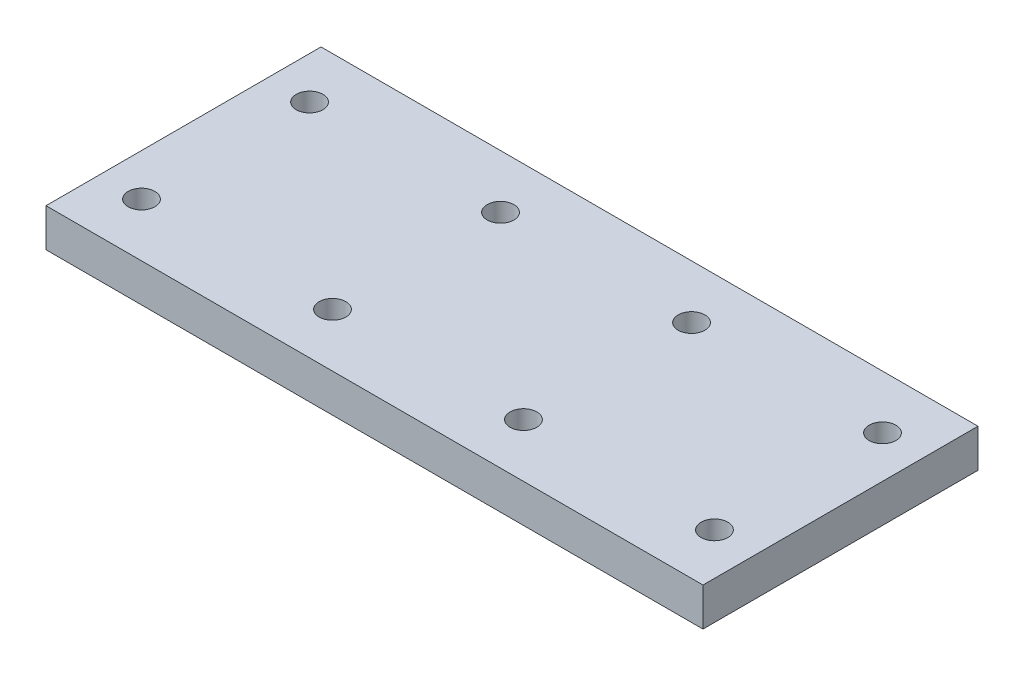
ISO-10303-21;
HEADER;
FILE_DESCRIPTION(('STEP AP214'),'2;1');
FILE_NAME('part.step','',(''),(''),'','','');
FILE_SCHEMA(('AUTOMOTIVE_DESIGN { 1 0 10303 214 1 1 1 1 }'));
ENDSEC;
DATA;
#1=APPLICATION_CONTEXT('core data for automotive mechanical design processes');
#2=APPLICATION_PROTOCOL_DEFINITION('international standard','automotive_design',2000,#1);
#3=PRODUCT_CONTEXT('',#1,'mechanical');
#4=PRODUCT('Part','Part','',(#3));
#5=PRODUCT_RELATED_PRODUCT_CATEGORY('part','',(#4));
#6=PRODUCT_DEFINITION_FORMATION('','',#4);
#7=PRODUCT_DEFINITION_CONTEXT('part definition',#1,'design');
#8=PRODUCT_DEFINITION('design','',#6,#7);
#9=PRODUCT_DEFINITION_SHAPE('','',#8);
#10=(LENGTH_UNIT() NAMED_UNIT(*) SI_UNIT(.MILLI.,.METRE.));
#11=(NAMED_UNIT(*) PLANE_ANGLE_UNIT() SI_UNIT($,.RADIAN.));
#12=(NAMED_UNIT(*) SI_UNIT($,.STERADIAN.) SOLID_ANGLE_UNIT());
#13=UNCERTAINTY_MEASURE_WITH_UNIT(LENGTH_MEASURE(1.E-05),#10,'distance_accuracy_value','');
#14=(GEOMETRIC_REPRESENTATION_CONTEXT(3) GLOBAL_UNCERTAINTY_ASSIGNED_CONTEXT((#13)) GLOBAL_UNIT_ASSIGNED_CONTEXT((#10,
#11,#12)) REPRESENTATION_CONTEXT('',''));
#15=CARTESIAN_POINT('',(0.,0.,0.));
#16=DIRECTION('',(0.,0.,1.));
#17=DIRECTION('',(1.,0.,0.));
#18=AXIS2_PLACEMENT_3D('',#15,#16,#17);
#19=CARTESIAN_POINT('',(43.,5.,-18.));
#20=DIRECTION('',(-1.,0.,0.));
#21=DIRECTION('',(0.,0.,1.));
#22=AXIS2_PLACEMENT_3D('',#19,#20,#21);
#23=PLANE('',#22);
#24=DIRECTION('',(0.,0.,-1.));
#25=VECTOR('',#24,1.);
#26=CARTESIAN_POINT('',(43.,0.,-18.));
#27=LINE('',#26,#25);
#28=CARTESIAN_POINT('',(43.,0.,18.));
#29=VERTEX_POINT('',#28);
#30=CARTESIAN_POINT('',(43.,0.,-18.));
#31=VERTEX_POINT('',#30);
#32=EDGE_CURVE('E98',#29,#31,#27,.T.);
#33=ORIENTED_EDGE('',*,*,#32,.T.);
#34=DIRECTION('',(0.,-1.,0.));
#35=VECTOR('',#34,1.);
#36=CARTESIAN_POINT('',(43.,5.,-18.));
#37=LINE('',#36,#35);
#38=CARTESIAN_POINT('',(43.,5.,-18.));
#39=VERTEX_POINT('',#38);
#40=EDGE_CURVE('E11',#39,#31,#37,.T.);
#41=ORIENTED_EDGE('',*,*,#40,.F.);
#42=DIRECTION('',(0.,0.,-1.));
#43=VECTOR('',#42,1.);
#44=CARTESIAN_POINT('',(43.,5.,-18.));
#45=LINE('',#44,#43);
#46=CARTESIAN_POINT('',(43.,5.,18.));
#47=VERTEX_POINT('',#46);
#48=EDGE_CURVE('E86',#47,#39,#45,.T.);
#49=ORIENTED_EDGE('',*,*,#48,.F.);
#50=DIRECTION('',(0.,-1.,0.));
#51=VECTOR('',#50,1.);
#52=CARTESIAN_POINT('',(43.,5.,18.));
#53=LINE('',#52,#51);
#54=EDGE_CURVE('E94',#47,#29,#53,.T.);
#55=ORIENTED_EDGE('',*,*,#54,.T.);
#56=EDGE_LOOP('',(#33,#41,#49,#55));
#57=FACE_BOUND('',#56,.T.);
#58=ADVANCED_FACE('F35',(#57),#23,.F.);
#59=CARTESIAN_POINT('',(-43.,5.,-18.));
#60=DIRECTION('',(0.,0.,1.));
#61=DIRECTION('',(1.,0.,0.));
#62=AXIS2_PLACEMENT_3D('',#59,#60,#61);
#63=PLANE('',#62);
#64=DIRECTION('',(-1.,0.,0.));
#65=VECTOR('',#64,1.);
#66=CARTESIAN_POINT('',(-43.,0.,-18.));
#67=LINE('',#66,#65);
#68=CARTESIAN_POINT('',(-43.,0.,-18.));
#69=VERTEX_POINT('',#68);
#70=EDGE_CURVE('E90',#31,#69,#67,.T.);
#71=ORIENTED_EDGE('',*,*,#70,.T.);
#72=DIRECTION('',(0.,-1.,0.));
#73=VECTOR('',#72,1.);
#74=CARTESIAN_POINT('',(-43.,5.,-18.));
#75=LINE('',#74,#73);
#76=CARTESIAN_POINT('',(-43.,5.,-18.));
#77=VERTEX_POINT('',#76);
#78=EDGE_CURVE('E43',#77,#69,#75,.T.);
#79=ORIENTED_EDGE('',*,*,#78,.F.);
#80=DIRECTION('',(-1.,0.,0.));
#81=VECTOR('',#80,1.);
#82=CARTESIAN_POINT('',(-43.,5.,-18.));
#83=LINE('',#82,#81);
#84=EDGE_CURVE('E81',#39,#77,#83,.T.);
#85=ORIENTED_EDGE('',*,*,#84,.F.);
#86=ORIENTED_EDGE('',*,*,#40,.T.);
#87=EDGE_LOOP('',(#71,#79,#85,#86));
#88=FACE_BOUND('',#87,.T.);
#89=ADVANCED_FACE('F89',(#88),#63,.F.);
#90=CARTESIAN_POINT('',(-43.,5.,-18.));
#91=DIRECTION('',(1.,0.,0.));
#92=DIRECTION('',(0.,0.,-1.));
#93=AXIS2_PLACEMENT_3D('',#90,#91,#92);
#94=PLANE('',#93);
#95=DIRECTION('',(0.,0.,1.));
#96=VECTOR('',#95,1.);
#97=CARTESIAN_POINT('',(-43.,0.,-18.));
#98=LINE('',#97,#96);
#99=CARTESIAN_POINT('',(-43.,0.,18.));
#100=VERTEX_POINT('',#99);
#101=EDGE_CURVE('E68',#69,#100,#98,.T.);
#102=ORIENTED_EDGE('',*,*,#101,.T.);
#103=DIRECTION('',(0.,-1.,0.));
#104=VECTOR('',#103,1.);
#105=CARTESIAN_POINT('',(-43.,5.,18.));
#106=LINE('',#105,#104);
#107=CARTESIAN_POINT('',(-43.,5.,18.));
#108=VERTEX_POINT('',#107);
#109=EDGE_CURVE('E91',#108,#100,#106,.T.);
#110=ORIENTED_EDGE('',*,*,#109,.F.);
#111=DIRECTION('',(0.,0.,1.));
#112=VECTOR('',#111,1.);
#113=CARTESIAN_POINT('',(-43.,5.,-18.));
#114=LINE('',#113,#112);
#115=EDGE_CURVE('E84',#77,#108,#114,.T.);
#116=ORIENTED_EDGE('',*,*,#115,.F.);
#117=ORIENTED_EDGE('',*,*,#78,.T.);
#118=EDGE_LOOP('',(#102,#110,#116,#117));
#119=FACE_BOUND('',#118,.T.);
#120=ADVANCED_FACE('F92',(#119),#94,.F.);
#121=CARTESIAN_POINT('',(-43.,5.,18.));
#122=DIRECTION('',(0.,0.,-1.));
#123=DIRECTION('',(-1.,0.,0.));
#124=AXIS2_PLACEMENT_3D('',#121,#122,#123);
#125=PLANE('',#124);
#126=DIRECTION('',(1.,0.,0.));
#127=VECTOR('',#126,1.);
#128=CARTESIAN_POINT('',(-43.,0.,18.));
#129=LINE('',#128,#127);
#130=EDGE_CURVE('E74',#100,#29,#129,.T.);
#131=ORIENTED_EDGE('',*,*,#130,.T.);
#132=ORIENTED_EDGE('',*,*,#54,.F.);
#133=DIRECTION('',(1.,0.,0.));
#134=VECTOR('',#133,1.);
#135=CARTESIAN_POINT('',(-43.,5.,18.));
#136=LINE('',#135,#134);
#137=EDGE_CURVE('E51',#108,#47,#136,.T.);
#138=ORIENTED_EDGE('',*,*,#137,.F.);
#139=ORIENTED_EDGE('',*,*,#109,.T.);
#140=EDGE_LOOP('',(#131,#132,#138,#139));
#141=FACE_BOUND('',#140,.T.);
#142=ADVANCED_FACE('F106',(#141),#125,.F.);
#143=CARTESIAN_POINT('',(0.,5.,0.));
#144=DIRECTION('',(0.,1.,0.));
#145=DIRECTION('',(0.,0.,1.));
#146=AXIS2_PLACEMENT_3D('',#143,#144,#145);
#147=PLANE('',#146);
#148=CARTESIAN_POINT('',(-37.5,5.,-11.));
#149=DIRECTION('',(0.,-1.,0.));
#150=DIRECTION('',(0.,0.,-1.));
#151=AXIS2_PLACEMENT_3D('',#148,#149,#150);
#152=CIRCLE('',#151,1.75);
#153=CARTESIAN_POINT('',(-37.5,5.,-12.75));
#154=VERTEX_POINT('',#153);
#155=EDGE_CURVE('E151',#154,#154,#152,.T.);
#156=ORIENTED_EDGE('',*,*,#155,.T.);
#157=EDGE_LOOP('',(#156));
#158=FACE_BOUND('',#157,.T.);
#159=CARTESIAN_POINT('',(-37.5,5.,11.));
#160=DIRECTION('',(0.,1.,0.));
#161=DIRECTION('',(0.,0.,1.));
#162=AXIS2_PLACEMENT_3D('',#159,#160,#161);
#163=CIRCLE('',#162,1.75);
#164=CARTESIAN_POINT('',(-37.5,5.,12.75));
#165=VERTEX_POINT('',#164);
#166=EDGE_CURVE('E145',#165,#165,#163,.T.);
#167=ORIENTED_EDGE('',*,*,#166,.F.);
#168=EDGE_LOOP('',(#167));
#169=FACE_BOUND('',#168,.T.);
#170=CARTESIAN_POINT('',(-12.5,5.,11.));
#171=DIRECTION('',(0.,1.,0.));
#172=DIRECTION('',(0.,0.,1.));
#173=AXIS2_PLACEMENT_3D('',#170,#171,#172);
#174=CIRCLE('',#173,1.75);
#175=CARTESIAN_POINT('',(-12.5,5.,12.75));
#176=VERTEX_POINT('',#175);
#177=EDGE_CURVE('E139',#176,#176,#174,.F.);
#178=ORIENTED_EDGE('',*,*,#177,.T.);
#179=EDGE_LOOP('',(#178));
#180=FACE_BOUND('',#179,.T.);
#181=CARTESIAN_POINT('',(-12.5,5.,-11.));
#182=DIRECTION('',(0.,1.,0.));
#183=DIRECTION('',(0.,0.,1.));
#184=AXIS2_PLACEMENT_3D('',#181,#182,#183);
#185=CIRCLE('',#184,1.75);
#186=CARTESIAN_POINT('',(-12.5,5.,-9.24999999999999));
#187=VERTEX_POINT('',#186);
#188=EDGE_CURVE('E133',#187,#187,#185,.T.);
#189=ORIENTED_EDGE('',*,*,#188,.F.);
#190=EDGE_LOOP('',(#189));
#191=FACE_BOUND('',#190,.T.);
#192=CARTESIAN_POINT('',(12.5,5.,-11.));
#193=DIRECTION('',(0.,1.,0.));
#194=DIRECTION('',(0.,0.,1.));
#195=AXIS2_PLACEMENT_3D('',#192,#193,#194);
#196=CIRCLE('',#195,1.75);
#197=CARTESIAN_POINT('',(12.5,5.,-9.24999999999999));
#198=VERTEX_POINT('',#197);
#199=EDGE_CURVE('E127',#198,#198,#196,.F.);
#200=ORIENTED_EDGE('',*,*,#199,.T.);
#201=EDGE_LOOP('',(#200));
#202=FACE_BOUND('',#201,.T.);
#203=CARTESIAN_POINT('',(37.5,5.,-11.));
#204=DIRECTION('',(0.,1.,0.));
#205=DIRECTION('',(0.,0.,1.));
#206=AXIS2_PLACEMENT_3D('',#203,#204,#205);
#207=CIRCLE('',#206,1.75);
#208=CARTESIAN_POINT('',(37.5,5.,-9.24999999999999));
#209=VERTEX_POINT('',#208);
#210=EDGE_CURVE('E121',#209,#209,#207,.T.);
#211=ORIENTED_EDGE('',*,*,#210,.F.);
#212=EDGE_LOOP('',(#211));
#213=FACE_BOUND('',#212,.T.);
#214=CARTESIAN_POINT('',(12.5,5.,11.));
#215=DIRECTION('',(0.,1.,0.));
#216=DIRECTION('',(0.,0.,1.));
#217=AXIS2_PLACEMENT_3D('',#214,#215,#216);
#218=CIRCLE('',#217,1.75);
#219=CARTESIAN_POINT('',(12.5,5.,12.75));
#220=VERTEX_POINT('',#219);
#221=EDGE_CURVE('E115',#220,#220,#218,.T.);
#222=ORIENTED_EDGE('',*,*,#221,.F.);
#223=EDGE_LOOP('',(#222));
#224=FACE_BOUND('',#223,.T.);
#225=CARTESIAN_POINT('',(37.5,5.,11.));
#226=DIRECTION('',(0.,1.,0.));
#227=DIRECTION('',(0.,0.,1.));
#228=AXIS2_PLACEMENT_3D('',#225,#226,#227);
#229=CIRCLE('',#228,1.75);
#230=CARTESIAN_POINT('',(37.5,5.,12.75));
#231=VERTEX_POINT('',#230);
#232=EDGE_CURVE('E112',#231,#231,#229,.F.);
#233=ORIENTED_EDGE('',*,*,#232,.T.);
#234=EDGE_LOOP('',(#233));
#235=FACE_BOUND('',#234,.T.);
#236=ORIENTED_EDGE('',*,*,#48,.T.);
#237=ORIENTED_EDGE('',*,*,#84,.T.);
#238=ORIENTED_EDGE('',*,*,#115,.T.);
#239=ORIENTED_EDGE('',*,*,#137,.T.);
#240=EDGE_LOOP('',(#236,#237,#238,#239));
#241=FACE_BOUND('',#240,.T.);
#242=ADVANCED_FACE('F82',(#158,#169,#180,#191,#202,#213,#224,#235,#241),#147,.T.);
#243=CARTESIAN_POINT('',(0.,0.,0.));
#244=DIRECTION('',(0.,1.,0.));
#245=DIRECTION('',(0.,0.,1.));
#246=AXIS2_PLACEMENT_3D('',#243,#244,#245);
#247=PLANE('',#246);
#248=CARTESIAN_POINT('',(-37.5,0.,-11.));
#249=DIRECTION('',(0.,-1.,0.));
#250=DIRECTION('',(0.,0.,-1.));
#251=AXIS2_PLACEMENT_3D('',#248,#249,#250);
#252=CIRCLE('',#251,1.75);
#253=CARTESIAN_POINT('',(-37.5,0.,-12.75));
#254=VERTEX_POINT('',#253);
#255=EDGE_CURVE('E154',#254,#254,#252,.T.);
#256=ORIENTED_EDGE('',*,*,#255,.F.);
#257=EDGE_LOOP('',(#256));
#258=FACE_BOUND('',#257,.T.);
#259=CARTESIAN_POINT('',(-37.5,0.,11.));
#260=DIRECTION('',(0.,1.,0.));
#261=DIRECTION('',(0.,0.,1.));
#262=AXIS2_PLACEMENT_3D('',#259,#260,#261);
#263=CIRCLE('',#262,1.75);
#264=CARTESIAN_POINT('',(-37.5,0.,12.75));
#265=VERTEX_POINT('',#264);
#266=EDGE_CURVE('E148',#265,#265,#263,.T.);
#267=ORIENTED_EDGE('',*,*,#266,.T.);
#268=EDGE_LOOP('',(#267));
#269=FACE_BOUND('',#268,.T.);
#270=CARTESIAN_POINT('',(-12.5,0.,11.));
#271=DIRECTION('',(0.,1.,0.));
#272=DIRECTION('',(0.,0.,1.));
#273=AXIS2_PLACEMENT_3D('',#270,#271,#272);
#274=CIRCLE('',#273,1.75);
#275=CARTESIAN_POINT('',(-12.5,0.,12.75));
#276=VERTEX_POINT('',#275);
#277=EDGE_CURVE('E142',#276,#276,#274,.F.);
#278=ORIENTED_EDGE('',*,*,#277,.F.);
#279=EDGE_LOOP('',(#278));
#280=FACE_BOUND('',#279,.T.);
#281=CARTESIAN_POINT('',(-12.5,0.,-11.));
#282=DIRECTION('',(0.,1.,0.));
#283=DIRECTION('',(0.,0.,1.));
#284=AXIS2_PLACEMENT_3D('',#281,#282,#283);
#285=CIRCLE('',#284,1.75);
#286=CARTESIAN_POINT('',(-12.5,0.,-9.24999999999999));
#287=VERTEX_POINT('',#286);
#288=EDGE_CURVE('E136',#287,#287,#285,.T.);
#289=ORIENTED_EDGE('',*,*,#288,.T.);
#290=EDGE_LOOP('',(#289));
#291=FACE_BOUND('',#290,.T.);
#292=CARTESIAN_POINT('',(12.5,0.,-11.));
#293=DIRECTION('',(0.,1.,0.));
#294=DIRECTION('',(0.,0.,1.));
#295=AXIS2_PLACEMENT_3D('',#292,#293,#294);
#296=CIRCLE('',#295,1.75);
#297=CARTESIAN_POINT('',(12.5,0.,-9.24999999999999));
#298=VERTEX_POINT('',#297);
#299=EDGE_CURVE('E130',#298,#298,#296,.F.);
#300=ORIENTED_EDGE('',*,*,#299,.F.);
#301=EDGE_LOOP('',(#300));
#302=FACE_BOUND('',#301,.T.);
#303=CARTESIAN_POINT('',(37.5,0.,-11.));
#304=DIRECTION('',(0.,1.,0.));
#305=DIRECTION('',(0.,0.,1.));
#306=AXIS2_PLACEMENT_3D('',#303,#304,#305);
#307=CIRCLE('',#306,1.75);
#308=CARTESIAN_POINT('',(37.5,0.,-9.24999999999999));
#309=VERTEX_POINT('',#308);
#310=EDGE_CURVE('E124',#309,#309,#307,.T.);
#311=ORIENTED_EDGE('',*,*,#310,.T.);
#312=EDGE_LOOP('',(#311));
#313=FACE_BOUND('',#312,.T.);
#314=CARTESIAN_POINT('',(12.5,0.,11.));
#315=DIRECTION('',(0.,1.,0.));
#316=DIRECTION('',(0.,0.,1.));
#317=AXIS2_PLACEMENT_3D('',#314,#315,#316);
#318=CIRCLE('',#317,1.75);
#319=CARTESIAN_POINT('',(12.5,0.,12.75));
#320=VERTEX_POINT('',#319);
#321=EDGE_CURVE('E118',#320,#320,#318,.T.);
#322=ORIENTED_EDGE('',*,*,#321,.T.);
#323=EDGE_LOOP('',(#322));
#324=FACE_BOUND('',#323,.T.);
#325=CARTESIAN_POINT('',(37.5,0.,11.));
#326=DIRECTION('',(0.,1.,0.));
#327=DIRECTION('',(0.,0.,1.));
#328=AXIS2_PLACEMENT_3D('',#325,#326,#327);
#329=CIRCLE('',#328,1.75);
#330=CARTESIAN_POINT('',(37.5,0.,12.75));
#331=VERTEX_POINT('',#330);
#332=EDGE_CURVE('E101',#331,#331,#329,.F.);
#333=ORIENTED_EDGE('',*,*,#332,.F.);
#334=EDGE_LOOP('',(#333));
#335=FACE_BOUND('',#334,.T.);
#336=ORIENTED_EDGE('',*,*,#32,.F.);
#337=ORIENTED_EDGE('',*,*,#130,.F.);
#338=ORIENTED_EDGE('',*,*,#101,.F.);
#339=ORIENTED_EDGE('',*,*,#70,.F.);
#340=EDGE_LOOP('',(#336,#337,#338,#339));
#341=FACE_BOUND('',#340,.T.);
#342=ADVANCED_FACE('F109',(#258,#269,#280,#291,#302,#313,#324,#335,#341),#247,.F.);
#343=CARTESIAN_POINT('',(37.5,0.,11.));
#344=DIRECTION('',(0.,1.,0.));
#345=DIRECTION('',(0.,0.,1.));
#346=AXIS2_PLACEMENT_3D('',#343,#344,#345);
#347=CYLINDRICAL_SURFACE('',#346,1.75);
#348=ORIENTED_EDGE('',*,*,#332,.T.);
#349=EDGE_LOOP('',(#348));
#350=FACE_BOUND('',#349,.T.);
#351=ORIENTED_EDGE('',*,*,#232,.F.);
#352=EDGE_LOOP('',(#351));
#353=FACE_BOUND('',#352,.T.);
#354=ADVANCED_FACE('F186',(#350,#353),#347,.F.);
#355=CARTESIAN_POINT('',(12.5,0.,11.));
#356=DIRECTION('',(0.,1.,0.));
#357=DIRECTION('',(0.,0.,1.));
#358=AXIS2_PLACEMENT_3D('',#355,#356,#357);
#359=CYLINDRICAL_SURFACE('',#358,1.75);
#360=ORIENTED_EDGE('',*,*,#321,.F.);
#361=EDGE_LOOP('',(#360));
#362=FACE_BOUND('',#361,.T.);
#363=ORIENTED_EDGE('',*,*,#221,.T.);
#364=EDGE_LOOP('',(#363));
#365=FACE_BOUND('',#364,.T.);
#366=ADVANCED_FACE('F192',(#362,#365),#359,.F.);
#367=CARTESIAN_POINT('',(37.5,0.,-11.));
#368=DIRECTION('',(0.,1.,0.));
#369=DIRECTION('',(0.,0.,1.));
#370=AXIS2_PLACEMENT_3D('',#367,#368,#369);
#371=CYLINDRICAL_SURFACE('',#370,1.75);
#372=ORIENTED_EDGE('',*,*,#310,.F.);
#373=EDGE_LOOP('',(#372));
#374=FACE_BOUND('',#373,.T.);
#375=ORIENTED_EDGE('',*,*,#210,.T.);
#376=EDGE_LOOP('',(#375));
#377=FACE_BOUND('',#376,.T.);
#378=ADVANCED_FACE('F196',(#374,#377),#371,.F.);
#379=CARTESIAN_POINT('',(12.5,0.,-11.));
#380=DIRECTION('',(0.,1.,0.));
#381=DIRECTION('',(0.,0.,1.));
#382=AXIS2_PLACEMENT_3D('',#379,#380,#381);
#383=CYLINDRICAL_SURFACE('',#382,1.75);
#384=ORIENTED_EDGE('',*,*,#299,.T.);
#385=EDGE_LOOP('',(#384));
#386=FACE_BOUND('',#385,.T.);
#387=ORIENTED_EDGE('',*,*,#199,.F.);
#388=EDGE_LOOP('',(#387));
#389=FACE_BOUND('',#388,.T.);
#390=ADVANCED_FACE('F200',(#386,#389),#383,.F.);
#391=CARTESIAN_POINT('',(-12.5,0.,-11.));
#392=DIRECTION('',(0.,1.,0.));
#393=DIRECTION('',(0.,0.,1.));
#394=AXIS2_PLACEMENT_3D('',#391,#392,#393);
#395=CYLINDRICAL_SURFACE('',#394,1.75);
#396=ORIENTED_EDGE('',*,*,#288,.F.);
#397=EDGE_LOOP('',(#396));
#398=FACE_BOUND('',#397,.T.);
#399=ORIENTED_EDGE('',*,*,#188,.T.);
#400=EDGE_LOOP('',(#399));
#401=FACE_BOUND('',#400,.T.);
#402=ADVANCED_FACE('F204',(#398,#401),#395,.F.);
#403=CARTESIAN_POINT('',(-12.5,0.,11.));
#404=DIRECTION('',(0.,1.,0.));
#405=DIRECTION('',(0.,0.,1.));
#406=AXIS2_PLACEMENT_3D('',#403,#404,#405);
#407=CYLINDRICAL_SURFACE('',#406,1.75);
#408=ORIENTED_EDGE('',*,*,#277,.T.);
#409=EDGE_LOOP('',(#408));
#410=FACE_BOUND('',#409,.T.);
#411=ORIENTED_EDGE('',*,*,#177,.F.);
#412=EDGE_LOOP('',(#411));
#413=FACE_BOUND('',#412,.T.);
#414=ADVANCED_FACE('F170',(#410,#413),#407,.F.);
#415=CARTESIAN_POINT('',(-37.5,0.,11.));
#416=DIRECTION('',(0.,1.,0.));
#417=DIRECTION('',(0.,0.,1.));
#418=AXIS2_PLACEMENT_3D('',#415,#416,#417);
#419=CYLINDRICAL_SURFACE('',#418,1.75);
#420=ORIENTED_EDGE('',*,*,#266,.F.);
#421=EDGE_LOOP('',(#420));
#422=FACE_BOUND('',#421,.T.);
#423=ORIENTED_EDGE('',*,*,#166,.T.);
#424=EDGE_LOOP('',(#423));
#425=FACE_BOUND('',#424,.T.);
#426=ADVANCED_FACE('F164',(#422,#425),#419,.F.);
#427=CARTESIAN_POINT('',(-37.5,0.,-11.));
#428=DIRECTION('',(0.,1.,0.));
#429=DIRECTION('',(0.,0.,1.));
#430=AXIS2_PLACEMENT_3D('',#427,#428,#429);
#431=CYLINDRICAL_SURFACE('',#430,1.75);
#432=ORIENTED_EDGE('',*,*,#255,.T.);
#433=EDGE_LOOP('',(#432));
#434=FACE_BOUND('',#433,.T.);
#435=ORIENTED_EDGE('',*,*,#155,.F.);
#436=EDGE_LOOP('',(#435));
#437=FACE_BOUND('',#436,.T.);
#438=ADVANCED_FACE('F162',(#434,#437),#431,.F.);
#439=CLOSED_SHELL('',(#58,#89,#120,#142,#242,#342,#354,#366,#378,#390,#402,#414,#426,#438));
#440=MANIFOLD_SOLID_BREP('B2',#439);
#441=ADVANCED_BREP_SHAPE_REPRESENTATION('',(#18,#440),#14);
#442=SHAPE_DEFINITION_REPRESENTATION(#9,#441);
ENDSEC;
END-ISO-10303-21;
